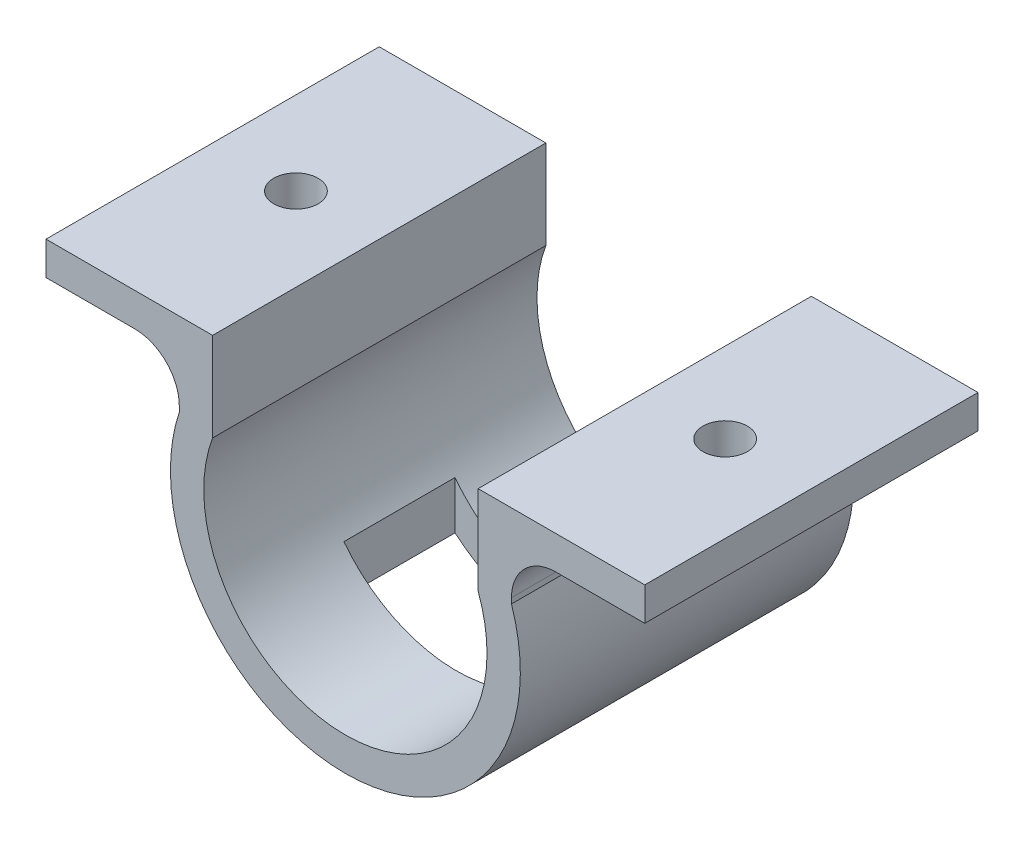
ISO-10303-21;
HEADER;
FILE_DESCRIPTION(('STEP AP214'),'2;1');
FILE_NAME('part.step','',(''),(''),'','','');
FILE_SCHEMA(('AUTOMOTIVE_DESIGN { 1 0 10303 214 1 1 1 1 }'));
ENDSEC;
DATA;
#1=APPLICATION_CONTEXT('core data for automotive mechanical design processes');
#2=APPLICATION_PROTOCOL_DEFINITION('international standard','automotive_design',2000,#1);
#3=PRODUCT_CONTEXT('',#1,'mechanical');
#4=PRODUCT('Part','Part','',(#3));
#5=PRODUCT_RELATED_PRODUCT_CATEGORY('part','',(#4));
#6=PRODUCT_DEFINITION_FORMATION('','',#4);
#7=PRODUCT_DEFINITION_CONTEXT('part definition',#1,'design');
#8=PRODUCT_DEFINITION('design','',#6,#7);
#9=PRODUCT_DEFINITION_SHAPE('','',#8);
#10=(LENGTH_UNIT() NAMED_UNIT(*) SI_UNIT(.MILLI.,.METRE.));
#11=(NAMED_UNIT(*) PLANE_ANGLE_UNIT() SI_UNIT($,.RADIAN.));
#12=(NAMED_UNIT(*) SI_UNIT($,.STERADIAN.) SOLID_ANGLE_UNIT());
#13=UNCERTAINTY_MEASURE_WITH_UNIT(LENGTH_MEASURE(1.E-05),#10,'distance_accuracy_value','');
#14=(GEOMETRIC_REPRESENTATION_CONTEXT(3) GLOBAL_UNCERTAINTY_ASSIGNED_CONTEXT((#13)) GLOBAL_UNIT_ASSIGNED_CONTEXT((#10,
#11,#12)) REPRESENTATION_CONTEXT('',''));
#15=CARTESIAN_POINT('',(0.,0.,0.));
#16=DIRECTION('',(0.,0.,1.));
#17=DIRECTION('',(1.,0.,0.));
#18=AXIS2_PLACEMENT_3D('',#15,#16,#17);
#19=CARTESIAN_POINT('',(12.0855734685662,9.43593893393396,15.));
#20=DIRECTION('',(0.,1.,0.));
#21=DIRECTION('',(-1.,0.,0.));
#22=AXIS2_PLACEMENT_3D('',#19,#20,#21);
#23=PLANE('',#22);
#24=DIRECTION('',(0.,0.,-1.));
#25=VECTOR('',#24,1.);
#26=CARTESIAN_POINT('',(19.0855734685662,9.43593893393396,-15.));
#27=LINE('',#26,#25);
#28=CARTESIAN_POINT('',(19.0855734685662,9.43593893393396,15.));
#29=VERTEX_POINT('',#28);
#30=CARTESIAN_POINT('',(19.0855734685662,9.43593893393396,1.98605672797808));
#31=VERTEX_POINT('',#30);
#32=EDGE_CURVE('E179',#29,#31,#27,.T.);
#33=ORIENTED_EDGE('',*,*,#32,.T.);
#34=CARTESIAN_POINT('',(19.321324763903,9.43593893393396,0.));
#35=DIRECTION('',(0.,1.,0.));
#36=DIRECTION('',(-1.,0.,0.));
#37=AXIS2_PLACEMENT_3D('',#34,#35,#36);
#38=CIRCLE('',#37,2.);
#39=CARTESIAN_POINT('',(19.0855734685662,9.43593893393396,-1.9860567279781));
#40=VERTEX_POINT('',#39);
#41=EDGE_CURVE('E51',#31,#40,#38,.T.);
#42=ORIENTED_EDGE('',*,*,#41,.T.);
#43=CARTESIAN_POINT('',(19.0855734685662,9.43593893393396,-15.));
#44=VERTEX_POINT('',#43);
#45=EDGE_CURVE('E176',#40,#44,#27,.T.);
#46=ORIENTED_EDGE('',*,*,#45,.T.);
#47=DIRECTION('',(1.,0.,0.));
#48=VECTOR('',#47,1.);
#49=CARTESIAN_POINT('',(12.0855734685662,9.43593893393396,-15.));
#50=LINE('',#49,#48);
#51=CARTESIAN_POINT('',(27.0855734685662,9.43593893393396,-15.));
#52=VERTEX_POINT('',#51);
#53=EDGE_CURVE('E332',#44,#52,#50,.T.);
#54=ORIENTED_EDGE('',*,*,#53,.T.);
#55=DIRECTION('',(0.,0.,-1.));
#56=VECTOR('',#55,1.);
#57=CARTESIAN_POINT('',(27.0855734685662,9.43593893393396,15.));
#58=LINE('',#57,#56);
#59=CARTESIAN_POINT('',(27.0855734685662,9.43593893393396,15.));
#60=VERTEX_POINT('',#59);
#61=EDGE_CURVE('E187',#60,#52,#58,.T.);
#62=ORIENTED_EDGE('',*,*,#61,.F.);
#63=DIRECTION('',(1.,0.,0.));
#64=VECTOR('',#63,1.);
#65=CARTESIAN_POINT('',(12.0855734685662,9.43593893393396,15.));
#66=LINE('',#65,#64);
#67=EDGE_CURVE('E366',#29,#60,#66,.T.);
#68=ORIENTED_EDGE('',*,*,#67,.F.);
#69=EDGE_LOOP('',(#33,#42,#46,#54,#62,#68));
#70=FACE_BOUND('',#69,.T.);
#71=ADVANCED_FACE('F33',(#70),#23,.F.);
#72=CARTESIAN_POINT('',(27.0855734685662,12.435938933934,15.));
#73=DIRECTION('',(1.,0.,0.));
#74=DIRECTION('',(0.,0.,-1.));
#75=AXIS2_PLACEMENT_3D('',#72,#73,#74);
#76=PLANE('',#75);
#77=DIRECTION('',(0.,-1.,0.));
#78=VECTOR('',#77,1.);
#79=CARTESIAN_POINT('',(27.0855734685662,12.435938933934,-15.));
#80=LINE('',#79,#78);
#81=CARTESIAN_POINT('',(27.0855734685662,12.435938933934,-15.));
#82=VERTEX_POINT('',#81);
#83=EDGE_CURVE('E334',#82,#52,#80,.T.);
#84=ORIENTED_EDGE('',*,*,#83,.F.);
#85=DIRECTION('',(0.,0.,-1.));
#86=VECTOR('',#85,1.);
#87=CARTESIAN_POINT('',(27.0855734685662,12.435938933934,15.));
#88=LINE('',#87,#86);
#89=CARTESIAN_POINT('',(27.0855734685662,12.435938933934,15.));
#90=VERTEX_POINT('',#89);
#91=EDGE_CURVE('E191',#90,#82,#88,.T.);
#92=ORIENTED_EDGE('',*,*,#91,.F.);
#93=DIRECTION('',(0.,-1.,0.));
#94=VECTOR('',#93,1.);
#95=CARTESIAN_POINT('',(27.0855734685662,12.435938933934,15.));
#96=LINE('',#95,#94);
#97=EDGE_CURVE('E399',#90,#60,#96,.T.);
#98=ORIENTED_EDGE('',*,*,#97,.T.);
#99=ORIENTED_EDGE('',*,*,#61,.T.);
#100=EDGE_LOOP('',(#84,#92,#98,#99));
#101=FACE_BOUND('',#100,.T.);
#102=ADVANCED_FACE('F293',(#101),#76,.T.);
#103=CARTESIAN_POINT('',(12.0855734685662,12.435938933934,15.));
#104=DIRECTION('',(0.,1.,0.));
#105=DIRECTION('',(-1.,0.,0.));
#106=AXIS2_PLACEMENT_3D('',#103,#104,#105);
#107=PLANE('',#106);
#108=CARTESIAN_POINT('',(19.321324763903,12.435938933934,0.));
#109=DIRECTION('',(0.,1.,0.));
#110=DIRECTION('',(-1.,0.,0.));
#111=AXIS2_PLACEMENT_3D('',#108,#109,#110);
#112=CIRCLE('',#111,2.);
#113=CARTESIAN_POINT('',(17.321324763903,12.435938933934,0.));
#114=VERTEX_POINT('',#113);
#115=EDGE_CURVE('E181',#114,#114,#112,.T.);
#116=ORIENTED_EDGE('',*,*,#115,.F.);
#117=EDGE_LOOP('',(#116));
#118=FACE_BOUND('',#117,.T.);
#119=DIRECTION('',(1.,0.,0.));
#120=VECTOR('',#119,1.);
#121=CARTESIAN_POINT('',(12.0855734685662,12.435938933934,-15.));
#122=LINE('',#121,#120);
#123=CARTESIAN_POINT('',(12.0855734685662,12.435938933934,-15.));
#124=VERTEX_POINT('',#123);
#125=EDGE_CURVE('E338',#124,#82,#122,.T.);
#126=ORIENTED_EDGE('',*,*,#125,.F.);
#127=DIRECTION('',(0.,0.,-1.));
#128=VECTOR('',#127,1.);
#129=CARTESIAN_POINT('',(12.0855734685662,12.435938933934,15.));
#130=LINE('',#129,#128);
#131=CARTESIAN_POINT('',(12.0855734685662,12.435938933934,15.));
#132=VERTEX_POINT('',#131);
#133=EDGE_CURVE('E382',#132,#124,#130,.T.);
#134=ORIENTED_EDGE('',*,*,#133,.F.);
#135=DIRECTION('',(1.,0.,0.));
#136=VECTOR('',#135,1.);
#137=CARTESIAN_POINT('',(12.0855734685662,12.435938933934,15.));
#138=LINE('',#137,#136);
#139=EDGE_CURVE('E388',#132,#90,#138,.T.);
#140=ORIENTED_EDGE('',*,*,#139,.T.);
#141=ORIENTED_EDGE('',*,*,#91,.T.);
#142=EDGE_LOOP('',(#126,#134,#140,#141));
#143=FACE_BOUND('',#142,.T.);
#144=ADVANCED_FACE('F289',(#118,#143),#107,.T.);
#145=CARTESIAN_POINT('',(12.0855734685662,4.43593893393397,15.));
#146=DIRECTION('',(-1.,0.,0.));
#147=DIRECTION('',(0.,-1.,0.));
#148=AXIS2_PLACEMENT_3D('',#145,#146,#147);
#149=PLANE('',#148);
#150=DIRECTION('',(0.,1.,0.));
#151=VECTOR('',#150,1.);
#152=CARTESIAN_POINT('',(12.0855734685662,4.43593893393397,-15.));
#153=LINE('',#152,#151);
#154=CARTESIAN_POINT('',(12.0855734685662,4.43593893393397,-15.));
#155=VERTEX_POINT('',#154);
#156=EDGE_CURVE('E341',#155,#124,#153,.T.);
#157=ORIENTED_EDGE('',*,*,#156,.F.);
#158=DIRECTION('',(0.,0.,-1.));
#159=VECTOR('',#158,1.);
#160=CARTESIAN_POINT('',(12.0855734685662,4.43593893393397,15.));
#161=LINE('',#160,#159);
#162=CARTESIAN_POINT('',(12.0855734685662,4.43593893393397,15.));
#163=VERTEX_POINT('',#162);
#164=EDGE_CURVE('E380',#163,#155,#161,.T.);
#165=ORIENTED_EDGE('',*,*,#164,.F.);
#166=DIRECTION('',(0.,1.,0.));
#167=VECTOR('',#166,1.);
#168=CARTESIAN_POINT('',(12.0855734685662,4.43593893393397,15.));
#169=LINE('',#168,#167);
#170=EDGE_CURVE('E396',#163,#132,#169,.T.);
#171=ORIENTED_EDGE('',*,*,#170,.T.);
#172=ORIENTED_EDGE('',*,*,#133,.T.);
#173=EDGE_LOOP('',(#157,#165,#171,#172));
#174=FACE_BOUND('',#173,.T.);
#175=ADVANCED_FACE('F285',(#174),#149,.T.);
#176=CARTESIAN_POINT('',(0.132124352331599,0.,15.));
#177=DIRECTION('',(0.,0.,-1.));
#178=DIRECTION('',(-1.,0.,0.));
#179=AXIS2_PLACEMENT_3D('',#176,#177,#178);
#180=CYLINDRICAL_SURFACE('',#179,12.75);
#181=DIRECTION('',(0.,0.,-1.));
#182=VECTOR('',#181,1.);
#183=CARTESIAN_POINT('',(10.,-8.07387950133971,15.));
#184=LINE('',#183,#182);
#185=CARTESIAN_POINT('',(10.,-8.07387950133971,5.));
#186=VERTEX_POINT('',#185);
#187=CARTESIAN_POINT('',(10.,-8.07387950133971,-5.));
#188=VERTEX_POINT('',#187);
#189=EDGE_CURVE('E335',#186,#188,#184,.T.);
#190=ORIENTED_EDGE('',*,*,#189,.F.);
#191=CARTESIAN_POINT('',(0.132124352331599,0.,5.));
#192=DIRECTION('',(0.,0.,1.));
#193=DIRECTION('',(1.,0.,0.));
#194=AXIS2_PLACEMENT_3D('',#191,#192,#193);
#195=CIRCLE('',#194,12.75);
#196=CARTESIAN_POINT('',(-9.99999999999999,-7.73967416038232,5.));
#197=VERTEX_POINT('',#196);
#198=EDGE_CURVE('E428',#197,#186,#195,.T.);
#199=ORIENTED_EDGE('',*,*,#198,.F.);
#200=DIRECTION('',(0.,0.,-1.));
#201=VECTOR('',#200,1.);
#202=CARTESIAN_POINT('',(-9.99999999999999,-7.73967416038232,15.));
#203=LINE('',#202,#201);
#204=CARTESIAN_POINT('',(-9.99999999999999,-7.73967416038232,-5.));
#205=VERTEX_POINT('',#204);
#206=EDGE_CURVE('E430',#205,#197,#203,.F.);
#207=ORIENTED_EDGE('',*,*,#206,.F.);
#208=CARTESIAN_POINT('',(0.132124352331599,0.,-5.));
#209=DIRECTION('',(0.,0.,-1.));
#210=DIRECTION('',(-1.,0.,0.));
#211=AXIS2_PLACEMENT_3D('',#208,#209,#210);
#212=CIRCLE('',#211,12.75);
#213=EDGE_CURVE('E432',#188,#205,#212,.T.);
#214=ORIENTED_EDGE('',*,*,#213,.F.);
#215=EDGE_LOOP('',(#190,#199,#207,#214));
#216=FACE_BOUND('',#215,.T.);
#217=CARTESIAN_POINT('',(0.132124352331599,0.,-15.));
#218=DIRECTION('',(0.,0.,1.));
#219=DIRECTION('',(1.,0.,0.));
#220=AXIS2_PLACEMENT_3D('',#217,#218,#219);
#221=CIRCLE('',#220,12.75);
#222=CARTESIAN_POINT('',(-11.821324763903,4.43593893393397,-15.));
#223=VERTEX_POINT('',#222);
#224=EDGE_CURVE('E344',#223,#155,#221,.T.);
#225=ORIENTED_EDGE('',*,*,#224,.F.);
#226=DIRECTION('',(0.,0.,-1.));
#227=VECTOR('',#226,1.);
#228=CARTESIAN_POINT('',(-11.821324763903,4.43593893393397,15.));
#229=LINE('',#228,#227);
#230=CARTESIAN_POINT('',(-11.821324763903,4.43593893393397,15.));
#231=VERTEX_POINT('',#230);
#232=EDGE_CURVE('E378',#231,#223,#229,.T.);
#233=ORIENTED_EDGE('',*,*,#232,.F.);
#234=CARTESIAN_POINT('',(0.132124352331599,0.,15.));
#235=DIRECTION('',(0.,0.,1.));
#236=DIRECTION('',(1.,0.,0.));
#237=AXIS2_PLACEMENT_3D('',#234,#235,#236);
#238=CIRCLE('',#237,12.75);
#239=EDGE_CURVE('E401',#231,#163,#238,.T.);
#240=ORIENTED_EDGE('',*,*,#239,.T.);
#241=ORIENTED_EDGE('',*,*,#164,.T.);
#242=EDGE_LOOP('',(#225,#233,#240,#241));
#243=FACE_BOUND('',#242,.T.);
#244=ADVANCED_FACE('F281',(#216,#243),#180,.F.);
#245=CARTESIAN_POINT('',(-11.821324763903,4.43593893393397,15.));
#246=DIRECTION('',(1.,0.,0.));
#247=DIRECTION('',(0.,1.,0.));
#248=AXIS2_PLACEMENT_3D('',#245,#246,#247);
#249=PLANE('',#248);
#250=DIRECTION('',(0.,-1.,0.));
#251=VECTOR('',#250,1.);
#252=CARTESIAN_POINT('',(-11.821324763903,4.43593893393397,-15.));
#253=LINE('',#252,#251);
#254=CARTESIAN_POINT('',(-11.821324763903,12.435938933934,-15.));
#255=VERTEX_POINT('',#254);
#256=EDGE_CURVE('E347',#255,#223,#253,.T.);
#257=ORIENTED_EDGE('',*,*,#256,.F.);
#258=DIRECTION('',(0.,0.,-1.));
#259=VECTOR('',#258,1.);
#260=CARTESIAN_POINT('',(-11.821324763903,12.435938933934,15.));
#261=LINE('',#260,#259);
#262=CARTESIAN_POINT('',(-11.821324763903,12.435938933934,15.));
#263=VERTEX_POINT('',#262);
#264=EDGE_CURVE('E376',#263,#255,#261,.T.);
#265=ORIENTED_EDGE('',*,*,#264,.F.);
#266=DIRECTION('',(0.,-1.,0.));
#267=VECTOR('',#266,1.);
#268=CARTESIAN_POINT('',(-11.821324763903,4.43593893393397,15.));
#269=LINE('',#268,#267);
#270=EDGE_CURVE('E407',#263,#231,#269,.T.);
#271=ORIENTED_EDGE('',*,*,#270,.T.);
#272=ORIENTED_EDGE('',*,*,#232,.T.);
#273=EDGE_LOOP('',(#257,#265,#271,#272));
#274=FACE_BOUND('',#273,.T.);
#275=ADVANCED_FACE('F277',(#274),#249,.T.);
#276=CARTESIAN_POINT('',(-11.821324763903,12.435938933934,15.));
#277=DIRECTION('',(0.,1.,0.));
#278=DIRECTION('',(-1.,0.,0.));
#279=AXIS2_PLACEMENT_3D('',#276,#277,#278);
#280=PLANE('',#279);
#281=CARTESIAN_POINT('',(-19.321324763903,12.435938933934,0.));
#282=DIRECTION('',(0.,1.,0.));
#283=DIRECTION('',(-1.,0.,0.));
#284=AXIS2_PLACEMENT_3D('',#281,#282,#283);
#285=CIRCLE('',#284,2.);
#286=CARTESIAN_POINT('',(-21.321324763903,12.435938933934,0.));
#287=VERTEX_POINT('',#286);
#288=EDGE_CURVE('E180',#287,#287,#285,.T.);
#289=ORIENTED_EDGE('',*,*,#288,.F.);
#290=EDGE_LOOP('',(#289));
#291=FACE_BOUND('',#290,.T.);
#292=DIRECTION('',(1.,0.,0.));
#293=VECTOR('',#292,1.);
#294=CARTESIAN_POINT('',(-11.821324763903,12.435938933934,-15.));
#295=LINE('',#294,#293);
#296=CARTESIAN_POINT('',(-26.821324763903,12.435938933934,-15.));
#297=VERTEX_POINT('',#296);
#298=EDGE_CURVE('E350',#297,#255,#295,.T.);
#299=ORIENTED_EDGE('',*,*,#298,.F.);
#300=DIRECTION('',(0.,0.,-1.));
#301=VECTOR('',#300,1.);
#302=CARTESIAN_POINT('',(-26.821324763903,12.435938933934,15.));
#303=LINE('',#302,#301);
#304=CARTESIAN_POINT('',(-26.821324763903,12.435938933934,15.));
#305=VERTEX_POINT('',#304);
#306=EDGE_CURVE('E374',#305,#297,#303,.T.);
#307=ORIENTED_EDGE('',*,*,#306,.F.);
#308=DIRECTION('',(1.,0.,0.));
#309=VECTOR('',#308,1.);
#310=CARTESIAN_POINT('',(-11.821324763903,12.435938933934,15.));
#311=LINE('',#310,#309);
#312=EDGE_CURVE('E324',#305,#263,#311,.T.);
#313=ORIENTED_EDGE('',*,*,#312,.T.);
#314=ORIENTED_EDGE('',*,*,#264,.T.);
#315=EDGE_LOOP('',(#299,#307,#313,#314));
#316=FACE_BOUND('',#315,.T.);
#317=ADVANCED_FACE('F273',(#291,#316),#280,.T.);
#318=CARTESIAN_POINT('',(-26.821324763903,9.43593893393396,15.));
#319=DIRECTION('',(-1.,0.,0.));
#320=DIRECTION('',(0.,0.,1.));
#321=AXIS2_PLACEMENT_3D('',#318,#319,#320);
#322=PLANE('',#321);
#323=DIRECTION('',(0.,1.,0.));
#324=VECTOR('',#323,1.);
#325=CARTESIAN_POINT('',(-26.821324763903,9.43593893393396,-15.));
#326=LINE('',#325,#324);
#327=CARTESIAN_POINT('',(-26.821324763903,9.43593893393396,-15.));
#328=VERTEX_POINT('',#327);
#329=EDGE_CURVE('E353',#328,#297,#326,.T.);
#330=ORIENTED_EDGE('',*,*,#329,.F.);
#331=DIRECTION('',(0.,0.,-1.));
#332=VECTOR('',#331,1.);
#333=CARTESIAN_POINT('',(-26.821324763903,9.43593893393396,15.));
#334=LINE('',#333,#332);
#335=CARTESIAN_POINT('',(-26.821324763903,9.43593893393396,15.));
#336=VERTEX_POINT('',#335);
#337=EDGE_CURVE('E372',#336,#328,#334,.T.);
#338=ORIENTED_EDGE('',*,*,#337,.F.);
#339=DIRECTION('',(0.,1.,0.));
#340=VECTOR('',#339,1.);
#341=CARTESIAN_POINT('',(-26.821324763903,9.43593893393396,15.));
#342=LINE('',#341,#340);
#343=EDGE_CURVE('E319',#336,#305,#342,.T.);
#344=ORIENTED_EDGE('',*,*,#343,.T.);
#345=ORIENTED_EDGE('',*,*,#306,.T.);
#346=EDGE_LOOP('',(#330,#338,#344,#345));
#347=FACE_BOUND('',#346,.T.);
#348=ADVANCED_FACE('F269',(#347),#322,.T.);
#349=CARTESIAN_POINT('',(-11.821324763903,9.43593893393396,15.));
#350=DIRECTION('',(0.,1.,0.));
#351=DIRECTION('',(-1.,0.,0.));
#352=AXIS2_PLACEMENT_3D('',#349,#350,#351);
#353=PLANE('',#352);
#354=DIRECTION('',(0.,0.,-1.));
#355=VECTOR('',#354,1.);
#356=CARTESIAN_POINT('',(-18.821324763903,9.43593893393396,15.));
#357=LINE('',#356,#355);
#358=CARTESIAN_POINT('',(-18.821324763903,9.43593893393396,-15.));
#359=VERTEX_POINT('',#358);
#360=CARTESIAN_POINT('',(-18.821324763903,9.43593893393396,-1.93649167310372));
#361=VERTEX_POINT('',#360);
#362=EDGE_CURVE('E200',#359,#361,#357,.F.);
#363=ORIENTED_EDGE('',*,*,#362,.T.);
#364=CARTESIAN_POINT('',(-19.321324763903,9.43593893393396,0.));
#365=DIRECTION('',(0.,1.,0.));
#366=DIRECTION('',(-1.,0.,0.));
#367=AXIS2_PLACEMENT_3D('',#364,#365,#366);
#368=CIRCLE('',#367,2.);
#369=CARTESIAN_POINT('',(-18.821324763903,9.43593893393396,1.93649167310372));
#370=VERTEX_POINT('',#369);
#371=EDGE_CURVE('E57',#361,#370,#368,.T.);
#372=ORIENTED_EDGE('',*,*,#371,.T.);
#373=CARTESIAN_POINT('',(-18.821324763903,9.43593893393396,15.));
#374=VERTEX_POINT('',#373);
#375=EDGE_CURVE('E199',#370,#374,#357,.F.);
#376=ORIENTED_EDGE('',*,*,#375,.T.);
#377=DIRECTION('',(1.,0.,0.));
#378=VECTOR('',#377,1.);
#379=CARTESIAN_POINT('',(-11.821324763903,9.43593893393396,15.));
#380=LINE('',#379,#378);
#381=EDGE_CURVE('E313',#336,#374,#380,.T.);
#382=ORIENTED_EDGE('',*,*,#381,.F.);
#383=ORIENTED_EDGE('',*,*,#337,.T.);
#384=DIRECTION('',(1.,0.,0.));
#385=VECTOR('',#384,1.);
#386=CARTESIAN_POINT('',(-11.821324763903,9.43593893393396,-15.));
#387=LINE('',#386,#385);
#388=EDGE_CURVE('E356',#328,#359,#387,.T.);
#389=ORIENTED_EDGE('',*,*,#388,.T.);
#390=EDGE_LOOP('',(#363,#372,#376,#382,#383,#389));
#391=FACE_BOUND('',#390,.T.);
#392=ADVANCED_FACE('F265',(#391),#353,.F.);
#393=CARTESIAN_POINT('',(-14.821324763903,4.43593893393398,15.));
#394=DIRECTION('',(1.,0.,0.));
#395=DIRECTION('',(0.,1.,0.));
#396=AXIS2_PLACEMENT_3D('',#393,#394,#395);
#397=PLANE('',#396);
#398=DIRECTION('',(0.,-1.,0.));
#399=VECTOR('',#398,1.);
#400=CARTESIAN_POINT('',(-14.821324763903,4.43593893393398,15.));
#401=LINE('',#400,#399);
#402=CARTESIAN_POINT('',(-14.821324763903,5.43593893393395,15.));
#403=VERTEX_POINT('',#402);
#404=CARTESIAN_POINT('',(-14.821324763903,4.94538770251473,15.));
#405=VERTEX_POINT('',#404);
#406=EDGE_CURVE('E320',#403,#405,#401,.T.);
#407=ORIENTED_EDGE('',*,*,#406,.F.);
#408=DIRECTION('',(0.,0.,-1.));
#409=VECTOR('',#408,1.);
#410=CARTESIAN_POINT('',(-14.821324763903,5.43593893393395,-15.));
#411=LINE('',#410,#409);
#412=CARTESIAN_POINT('',(-14.821324763903,5.43593893393395,-15.));
#413=VERTEX_POINT('',#412);
#414=EDGE_CURVE('E196',#403,#413,#411,.T.);
#415=ORIENTED_EDGE('',*,*,#414,.T.);
#416=DIRECTION('',(0.,-1.,0.));
#417=VECTOR('',#416,1.);
#418=CARTESIAN_POINT('',(-14.821324763903,4.43593893393398,-15.));
#419=LINE('',#418,#417);
#420=CARTESIAN_POINT('',(-14.821324763903,4.94538770251473,-15.));
#421=VERTEX_POINT('',#420);
#422=EDGE_CURVE('E359',#413,#421,#419,.T.);
#423=ORIENTED_EDGE('',*,*,#422,.T.);
#424=DIRECTION('',(0.,0.,-1.));
#425=VECTOR('',#424,1.);
#426=CARTESIAN_POINT('',(-14.821324763903,4.94538770251473,15.));
#427=LINE('',#426,#425);
#428=EDGE_CURVE('E369',#405,#421,#427,.T.);
#429=ORIENTED_EDGE('',*,*,#428,.F.);
#430=EDGE_LOOP('',(#407,#415,#423,#429));
#431=FACE_BOUND('',#430,.T.);
#432=ADVANCED_FACE('F261',(#431),#397,.F.);
#433=CARTESIAN_POINT('',(0.132124352331599,0.,15.));
#434=DIRECTION('',(0.,0.,-1.));
#435=DIRECTION('',(-1.,0.,0.));
#436=AXIS2_PLACEMENT_3D('',#433,#434,#435);
#437=CYLINDRICAL_SURFACE('',#436,15.75);
#438=DIRECTION('',(0.,0.,-1.));
#439=VECTOR('',#438,1.);
#440=CARTESIAN_POINT('',(10.,-12.2754849273727,15.));
#441=LINE('',#440,#439);
#442=CARTESIAN_POINT('',(10.,-12.2754849273727,5.));
#443=VERTEX_POINT('',#442);
#444=CARTESIAN_POINT('',(10.,-12.2754849273727,-5.));
#445=VERTEX_POINT('',#444);
#446=EDGE_CURVE('E219',#443,#445,#441,.T.);
#447=ORIENTED_EDGE('',*,*,#446,.T.);
#448=CARTESIAN_POINT('',(0.132124352331599,0.,-5.));
#449=DIRECTION('',(0.,0.,-1.));
#450=DIRECTION('',(-1.,0.,0.));
#451=AXIS2_PLACEMENT_3D('',#448,#449,#450);
#452=CIRCLE('',#451,15.75);
#453=CARTESIAN_POINT('',(-9.99999999999999,-12.058298226072,-5.));
#454=VERTEX_POINT('',#453);
#455=EDGE_CURVE('E210',#445,#454,#452,.T.);
#456=ORIENTED_EDGE('',*,*,#455,.T.);
#457=DIRECTION('',(0.,0.,-1.));
#458=VECTOR('',#457,1.);
#459=CARTESIAN_POINT('',(-9.99999999999999,-12.058298226072,15.));
#460=LINE('',#459,#458);
#461=CARTESIAN_POINT('',(-9.99999999999999,-12.058298226072,5.));
#462=VERTEX_POINT('',#461);
#463=EDGE_CURVE('E213',#454,#462,#460,.F.);
#464=ORIENTED_EDGE('',*,*,#463,.T.);
#465=CARTESIAN_POINT('',(0.132124352331599,0.,5.));
#466=DIRECTION('',(0.,0.,1.));
#467=DIRECTION('',(1.,0.,0.));
#468=AXIS2_PLACEMENT_3D('',#465,#466,#467);
#469=CIRCLE('',#468,15.75);
#470=EDGE_CURVE('E216',#462,#443,#469,.T.);
#471=ORIENTED_EDGE('',*,*,#470,.T.);
#472=EDGE_LOOP('',(#447,#456,#464,#471));
#473=FACE_BOUND('',#472,.T.);
#474=CARTESIAN_POINT('',(0.132124352331599,0.,-15.));
#475=DIRECTION('',(0.,0.,1.));
#476=DIRECTION('',(1.,0.,0.));
#477=AXIS2_PLACEMENT_3D('',#474,#475,#476);
#478=CIRCLE('',#477,15.75);
#479=CARTESIAN_POINT('',(15.0855734685662,4.94538770251473,-15.));
#480=VERTEX_POINT('',#479);
#481=EDGE_CURVE('E361',#421,#480,#478,.T.);
#482=ORIENTED_EDGE('',*,*,#481,.T.);
#483=DIRECTION('',(0.,0.,-1.));
#484=VECTOR('',#483,1.);
#485=CARTESIAN_POINT('',(15.0855734685662,4.94538770251473,15.));
#486=LINE('',#485,#484);
#487=CARTESIAN_POINT('',(15.0855734685662,4.94538770251473,15.));
#488=VERTEX_POINT('',#487);
#489=EDGE_CURVE('E331',#488,#480,#486,.T.);
#490=ORIENTED_EDGE('',*,*,#489,.F.);
#491=CARTESIAN_POINT('',(0.132124352331599,0.,15.));
#492=DIRECTION('',(0.,0.,1.));
#493=DIRECTION('',(1.,0.,0.));
#494=AXIS2_PLACEMENT_3D('',#491,#492,#493);
#495=CIRCLE('',#494,15.75);
#496=EDGE_CURVE('E322',#405,#488,#495,.T.);
#497=ORIENTED_EDGE('',*,*,#496,.F.);
#498=ORIENTED_EDGE('',*,*,#428,.T.);
#499=EDGE_LOOP('',(#482,#490,#497,#498));
#500=FACE_BOUND('',#499,.T.);
#501=ADVANCED_FACE('F257',(#473,#500),#437,.T.);
#502=CARTESIAN_POINT('',(15.0855734685662,4.43593893393398,15.));
#503=DIRECTION('',(-1.,0.,0.));
#504=DIRECTION('',(0.,-1.,0.));
#505=AXIS2_PLACEMENT_3D('',#502,#503,#504);
#506=PLANE('',#505);
#507=DIRECTION('',(0.,1.,0.));
#508=VECTOR('',#507,1.);
#509=CARTESIAN_POINT('',(15.0855734685662,4.43593893393398,-15.));
#510=LINE('',#509,#508);
#511=CARTESIAN_POINT('',(15.0855734685662,5.43593893393395,-15.));
#512=VERTEX_POINT('',#511);
#513=EDGE_CURVE('E363',#480,#512,#510,.T.);
#514=ORIENTED_EDGE('',*,*,#513,.T.);
#515=DIRECTION('',(0.,0.,-1.));
#516=VECTOR('',#515,1.);
#517=CARTESIAN_POINT('',(15.0855734685662,5.43593893393395,15.));
#518=LINE('',#517,#516);
#519=CARTESIAN_POINT('',(15.0855734685662,5.43593893393395,15.));
#520=VERTEX_POINT('',#519);
#521=EDGE_CURVE('E189',#512,#520,#518,.F.);
#522=ORIENTED_EDGE('',*,*,#521,.T.);
#523=DIRECTION('',(0.,1.,0.));
#524=VECTOR('',#523,1.);
#525=CARTESIAN_POINT('',(15.0855734685662,4.43593893393398,15.));
#526=LINE('',#525,#524);
#527=EDGE_CURVE('E329',#488,#520,#526,.T.);
#528=ORIENTED_EDGE('',*,*,#527,.F.);
#529=ORIENTED_EDGE('',*,*,#489,.T.);
#530=EDGE_LOOP('',(#514,#522,#528,#529));
#531=FACE_BOUND('',#530,.T.);
#532=ADVANCED_FACE('F250',(#531),#506,.F.);
#533=CARTESIAN_POINT('',(0.132124352331599,0.,15.));
#534=DIRECTION('',(0.,0.,1.));
#535=DIRECTION('',(1.,0.,0.));
#536=AXIS2_PLACEMENT_3D('',#533,#534,#535);
#537=PLANE('',#536);
#538=ORIENTED_EDGE('',*,*,#527,.T.);
#539=CARTESIAN_POINT('',(19.0855734685662,5.43593893393396,15.));
#540=DIRECTION('',(0.,0.,1.));
#541=DIRECTION('',(1.,0.,0.));
#542=AXIS2_PLACEMENT_3D('',#539,#540,#541);
#543=CIRCLE('',#542,4.);
#544=EDGE_CURVE('E204',#520,#29,#543,.F.);
#545=ORIENTED_EDGE('',*,*,#544,.T.);
#546=ORIENTED_EDGE('',*,*,#67,.T.);
#547=ORIENTED_EDGE('',*,*,#97,.F.);
#548=ORIENTED_EDGE('',*,*,#139,.F.);
#549=ORIENTED_EDGE('',*,*,#170,.F.);
#550=ORIENTED_EDGE('',*,*,#239,.F.);
#551=ORIENTED_EDGE('',*,*,#270,.F.);
#552=ORIENTED_EDGE('',*,*,#312,.F.);
#553=ORIENTED_EDGE('',*,*,#343,.F.);
#554=ORIENTED_EDGE('',*,*,#381,.T.);
#555=CARTESIAN_POINT('',(-18.821324763903,5.43593893393396,15.));
#556=DIRECTION('',(0.,0.,1.));
#557=DIRECTION('',(1.,0.,0.));
#558=AXIS2_PLACEMENT_3D('',#555,#556,#557);
#559=CIRCLE('',#558,4.);
#560=EDGE_CURVE('E208',#374,#403,#559,.F.);
#561=ORIENTED_EDGE('',*,*,#560,.T.);
#562=ORIENTED_EDGE('',*,*,#406,.T.);
#563=ORIENTED_EDGE('',*,*,#496,.T.);
#564=EDGE_LOOP('',(#538,#545,#546,#547,#548,#549,#550,#551,#552,#553,#554,#561,#562,#563));
#565=FACE_BOUND('',#564,.T.);
#566=ADVANCED_FACE('F246',(#565),#537,.T.);
#567=CARTESIAN_POINT('',(0.132124352331599,0.,-15.));
#568=DIRECTION('',(0.,0.,1.));
#569=DIRECTION('',(1.,0.,0.));
#570=AXIS2_PLACEMENT_3D('',#567,#568,#569);
#571=PLANE('',#570);
#572=ORIENTED_EDGE('',*,*,#53,.F.);
#573=CARTESIAN_POINT('',(19.0855734685662,5.43593893393396,-15.));
#574=DIRECTION('',(0.,0.,1.));
#575=DIRECTION('',(1.,0.,0.));
#576=AXIS2_PLACEMENT_3D('',#573,#574,#575);
#577=CIRCLE('',#576,4.);
#578=EDGE_CURVE('E185',#44,#512,#577,.T.);
#579=ORIENTED_EDGE('',*,*,#578,.T.);
#580=ORIENTED_EDGE('',*,*,#513,.F.);
#581=ORIENTED_EDGE('',*,*,#481,.F.);
#582=ORIENTED_EDGE('',*,*,#422,.F.);
#583=CARTESIAN_POINT('',(-18.821324763903,5.43593893393396,-15.));
#584=DIRECTION('',(0.,0.,1.));
#585=DIRECTION('',(1.,0.,0.));
#586=AXIS2_PLACEMENT_3D('',#583,#584,#585);
#587=CIRCLE('',#586,4.);
#588=EDGE_CURVE('E206',#413,#359,#587,.T.);
#589=ORIENTED_EDGE('',*,*,#588,.T.);
#590=ORIENTED_EDGE('',*,*,#388,.F.);
#591=ORIENTED_EDGE('',*,*,#329,.T.);
#592=ORIENTED_EDGE('',*,*,#298,.T.);
#593=ORIENTED_EDGE('',*,*,#256,.T.);
#594=ORIENTED_EDGE('',*,*,#224,.T.);
#595=ORIENTED_EDGE('',*,*,#156,.T.);
#596=ORIENTED_EDGE('',*,*,#125,.T.);
#597=ORIENTED_EDGE('',*,*,#83,.T.);
#598=EDGE_LOOP('',(#572,#579,#580,#581,#582,#589,#590,#591,#592,#593,#594,#595,#596,#597));
#599=FACE_BOUND('',#598,.T.);
#600=ADVANCED_FACE('F249',(#599),#571,.F.);
#601=CARTESIAN_POINT('',(19.0855734685662,5.43593893393396,15.));
#602=DIRECTION('',(0.,0.,1.));
#603=DIRECTION('',(1.,0.,0.));
#604=AXIS2_PLACEMENT_3D('',#601,#602,#603);
#605=CYLINDRICAL_SURFACE('',#604,4.);
#606=ORIENTED_EDGE('',*,*,#45,.F.);
#607=CARTESIAN_POINT('',(17.321324763903,9.0258451316074,0.));
#608=CARTESIAN_POINT('',(17.3213317186925,9.02585335886435,0.106314457676243));
#609=CARTESIAN_POINT('',(17.3298524206275,9.03007501996434,0.212757782375945));
#610=CARTESIAN_POINT('',(17.3635579652187,9.04633950173604,0.422466868378081));
#611=CARTESIAN_POINT('',(17.3887761878933,9.05839798811432,0.525725830182462));
#612=CARTESIAN_POINT('',(17.4546753877422,9.08853614829856,0.725711392612194));
#613=CARTESIAN_POINT('',(17.4952892980225,9.10658966476933,0.822464212999765));
#614=CARTESIAN_POINT('',(17.5906699929465,9.14645458851813,1.00782389552252));
#615=CARTESIAN_POINT('',(17.6454372128798,9.16826611136796,1.09643050700478));
#616=CARTESIAN_POINT('',(17.7718163627237,9.21467614676972,1.26933915855915));
#617=CARTESIAN_POINT('',(17.8442918978642,9.23936365951449,1.35298689114948));
#618=CARTESIAN_POINT('',(18.0022891890112,9.28734233221327,1.50743288142119));
#619=CARTESIAN_POINT('',(18.087815164785,9.31063303711393,1.57822696669468));
#620=CARTESIAN_POINT('',(18.273563522551,9.35385351325454,1.70747232569658));
#621=CARTESIAN_POINT('',(18.374215749666,9.37362511206582,1.76536331586888));
#622=CARTESIAN_POINT('',(18.5849852381373,9.40591910350905,1.86313514016607));
#623=CARTESIAN_POINT('',(18.6950958801239,9.41844651919009,1.90302844948566));
#624=CARTESIAN_POINT('',(18.9127039008271,9.43357621212015,1.96079905993294));
#625=CARTESIAN_POINT('',(19.019773770535,9.43685479222377,1.98010791107754));
#626=CARTESIAN_POINT('',(19.2355169650528,9.43458055318421,2.00109205570251));
#627=CARTESIAN_POINT('',(19.3441896235708,9.4290313067228,2.00277448062794));
#628=CARTESIAN_POINT('',(19.552380859103,9.40989176755314,1.98916409834091));
#629=CARTESIAN_POINT('',(19.6520279885131,9.39686010811018,1.97499148945252));
#630=CARTESIAN_POINT('',(19.8470104478028,9.36404204471291,1.93225793171226));
#631=CARTESIAN_POINT('',(19.9423451116271,9.34425460134238,1.90369476846897));
#632=CARTESIAN_POINT('',(20.1301094340116,9.29840461550138,1.83203434380262));
#633=CARTESIAN_POINT('',(20.2222917742882,9.27213253824261,1.78842692805914));
#634=CARTESIAN_POINT('',(20.3980911444772,9.21560004975302,1.68843525556301));
#635=CARTESIAN_POINT('',(20.4817046160287,9.18533799345092,1.63204572179886));
#636=CARTESIAN_POINT('',(20.6477324666424,9.11948034103153,1.50100517059112));
#637=CARTESIAN_POINT('',(20.7290172677418,9.08366329000246,1.42503194285892));
#638=CARTESIAN_POINT('',(20.8781329535295,9.01274788152049,1.26043555113181));
#639=CARTESIAN_POINT('',(20.9459504543688,8.97765026979728,1.17179995211205));
#640=CARTESIAN_POINT('',(21.0700929112081,8.90969538180193,0.977678499578119));
#641=CARTESIAN_POINT('',(21.1254939048983,8.87709568112525,0.87150382716589));
#642=CARTESIAN_POINT('',(21.2169401495574,8.82122808892954,0.64888909480292));
#643=CARTESIAN_POINT('',(21.2530183230151,8.79794434199644,0.532466891459127));
#644=CARTESIAN_POINT('',(21.3006073626486,8.76675721700252,0.306856071423419));
#645=CARTESIAN_POINT('',(21.3144619630934,8.75739571830103,0.19837003529823));
#646=CARTESIAN_POINT('',(21.3241970376518,8.75084681233539,-0.019741001353785));
#647=CARTESIAN_POINT('',(21.3200917015954,8.75364979411506,-0.129365034471651));
#648=CARTESIAN_POINT('',(21.2960249765642,8.76971348956773,-0.330815895429599));
#649=CARTESIAN_POINT('',(21.2782854098019,8.78150707095168,-0.423042955913128));
#650=CARTESIAN_POINT('',(21.2305327340907,8.81232055117007,-0.602988346930411));
#651=CARTESIAN_POINT('',(21.2005150198789,8.83134316126412,-0.690704971787036));
#652=CARTESIAN_POINT('',(21.1269777230482,8.87608849443625,-0.865562130639484));
#653=CARTESIAN_POINT('',(21.0827050635446,8.90216735812548,-0.952291763364204));
#654=CARTESIAN_POINT('',(20.9827251754457,8.95788320121761,-1.11762905990355));
#655=CARTESIAN_POINT('',(20.9270117063947,8.98752211879464,-1.19623225577753));
#656=CARTESIAN_POINT('',(20.7952996571099,9.05299227316861,-1.35639846324208));
#657=CARTESIAN_POINT('',(20.7174768971511,9.08904861386883,-1.43637673014104));
#658=CARTESIAN_POINT('',(20.5492061579006,9.15966164748132,-1.5826376873888));
#659=CARTESIAN_POINT('',(20.4587510247511,9.19421747599746,-1.64891256422495));
#660=CARTESIAN_POINT('',(20.2617717093932,9.26058261135379,-1.76905119005813));
#661=CARTESIAN_POINT('',(20.1546542913299,9.29215351827813,-1.82208383657239));
#662=CARTESIAN_POINT('',(19.9308918436491,9.34728997801847,-1.90860637348146));
#663=CARTESIAN_POINT('',(19.8142557334059,9.37086292076993,-1.94211432490099));
#664=CARTESIAN_POINT('',(19.5865642796886,9.40595215464515,-1.98539234768388));
#665=CARTESIAN_POINT('',(19.4760224334556,9.41839695915234,-1.99710566351994));
#666=CARTESIAN_POINT('',(19.2538958458194,9.43394296379188,-2.00194224632215));
#667=CARTESIAN_POINT('',(19.1423116957481,9.43704917319531,-1.99507548349667));
#668=CARTESIAN_POINT('',(18.9316884878469,9.43424432409326,-1.96430957571124));
#669=CARTESIAN_POINT('',(18.8324073808254,9.42910010401514,-1.94195680151471));
#670=CARTESIAN_POINT('',(18.638910141998,9.41210890217969,-1.8826976056761));
#671=CARTESIAN_POINT('',(18.5446944263549,9.40026137061001,-1.84578999030659));
#672=CARTESIAN_POINT('',(18.3615527766193,9.37098566292643,-1.75766837602128));
#673=CARTESIAN_POINT('',(18.2727904517354,9.35343957273263,-1.70615530902011));
#674=CARTESIAN_POINT('',(18.1046710295451,9.31476387172766,-1.59064967776522));
#675=CARTESIAN_POINT('',(18.0253174699638,9.29363292021106,-1.52665244319986));
#676=CARTESIAN_POINT('',(17.8708663612909,9.24796395958033,-1.38144092066168));
#677=CARTESIAN_POINT('',(17.7967692431228,9.22328997014569,-1.29920344082405));
#678=CARTESIAN_POINT('',(17.6629317207595,9.17507849792931,-1.12336512283937));
#679=CARTESIAN_POINT('',(17.6032029087443,9.15154194496918,-1.02975520056008));
#680=CARTESIAN_POINT('',(17.4977189526871,9.10773895149907,-0.829326273047571));
#681=CARTESIAN_POINT('',(17.4525997516278,9.08763587801627,-0.722134455465661));
#682=CARTESIAN_POINT('',(17.3815333866413,9.05502865266784,-0.500650597086852));
#683=CARTESIAN_POINT('',(17.3555319771,9.04250301832557,-0.386379651090798));
#684=CARTESIAN_POINT('',(17.3335944171614,9.03185337241852,-0.225793407379881));
#685=CARTESIAN_POINT('',(17.3289996609616,9.02960837154062,-0.180795367836707));
#686=CARTESIAN_POINT('',(17.3228632939798,9.02660247025449,-0.0905393513431189));
#687=CARTESIAN_POINT('',(17.3213218017249,9.02584162746104,-0.0452813643699841));
#688=CARTESIAN_POINT('',(17.321324763903,9.0258451316074,0.));
#689=B_SPLINE_CURVE_WITH_KNOTS('',3,(#607,#608,#609,#610,#611,#612,#613,#614,#615,#616,#617,
#618,#619,#620,#621,#622,#623,#624,#625,#626,#627,#628,#629,#630,#631,#632,#633,#634,#635,#636,
#637,#638,#639,#640,#641,#642,#643,#644,#645,#646,#647,#648,#649,#650,#651,#652,#653,#654,#655,
#656,#657,#658,#659,#660,#661,#662,#663,#664,#665,#666,#667,#668,#669,#670,#671,#672,#673,#674,
#675,#676,#677,#678,#679,#680,#681,#682,#683,#684,#685,#686,#687,#688),.UNSPECIFIED.,.T.,.F.,(4,
2,2,2,2,2,2,2,2,2,2,2,2,2,2,2,2,2,2,2,2,2,2,2,2,2,2,2,2,2,2,2,2,2,2,2,2,2,2,2,4),(0.,
0.318758246434048,0.638155654322305,0.956177397080625,1.27420892186377,1.61291545829492,
1.95173174606523,2.30321281770873,2.6544498825116,2.97924004139516,3.30389878891734,
3.60699126785829,3.91013040035056,4.22476684931328,4.53953343116443,4.88869801475344,
5.23820788158076,5.60851474648679,5.978188653924,6.30544934915751,6.63245152818512,
6.91518437927004,7.19802337461564,7.49931414021264,7.80076968521474,8.15107940802982,
8.50158832585645,8.87044189575177,9.23895371931427,9.57265707104741,9.90618139059779,
10.2104589817075,10.5147615335894,10.8258113372988,11.1369777282844,11.4757206995556,
11.8147360549141,12.1669752362886,12.5182110613524,12.6539710354229,12.7897362795693),.UNSPECIFIED.);
#690=EDGE_CURVE('E11',#40,#31,#689,.T.);
#691=ORIENTED_EDGE('',*,*,#690,.T.);
#692=ORIENTED_EDGE('',*,*,#32,.F.);
#693=ORIENTED_EDGE('',*,*,#544,.F.);
#694=ORIENTED_EDGE('',*,*,#521,.F.);
#695=ORIENTED_EDGE('',*,*,#578,.F.);
#696=EDGE_LOOP('',(#606,#691,#692,#693,#694,#695));
#697=FACE_BOUND('',#696,.T.);
#698=ADVANCED_FACE('F183',(#697),#605,.F.);
#699=CARTESIAN_POINT('',(-18.821324763903,5.43593893393396,15.));
#700=DIRECTION('',(0.,0.,1.));
#701=DIRECTION('',(1.,0.,0.));
#702=AXIS2_PLACEMENT_3D('',#699,#700,#701);
#703=CYLINDRICAL_SURFACE('',#702,4.);
#704=ORIENTED_EDGE('',*,*,#375,.F.);
#705=CARTESIAN_POINT('',(-21.321324763903,8.55843793313318,0.));
#706=CARTESIAN_POINT('',(-21.3213161620489,8.55845030973678,0.0986192451236804));
#707=CARTESIAN_POINT('',(-21.3139710688821,8.56436962031891,0.197320222559402));
#708=CARTESIAN_POINT('',(-21.2851199083688,8.5871330823903,0.391382754686682));
#709=CARTESIAN_POINT('',(-21.2635895993299,8.60399593500295,0.486738297891911));
#710=CARTESIAN_POINT('',(-21.2079135027116,8.64613980240615,0.6707938719814));
#711=CARTESIAN_POINT('',(-21.1738657985144,8.67135522029744,0.759539363467065));
#712=CARTESIAN_POINT('',(-21.0945382715059,8.7275736595619,0.929810808867028));
#713=CARTESIAN_POINT('',(-21.0492560449164,8.75857791918444,1.01133521265946));
#714=CARTESIAN_POINT('',(-20.942285391586,8.82799978197967,1.17614220591145));
#715=CARTESIAN_POINT('',(-20.8792517488256,8.86685947516423,1.25836347710665));
#716=CARTESIAN_POINT('',(-20.7416146122175,8.94575256502435,1.41188454664234));
#717=CARTESIAN_POINT('',(-20.6670023638288,8.98578683106154,1.48317599923035));
#718=CARTESIAN_POINT('',(-20.4947094728595,9.07054571602738,1.62400637949067));
#719=CARTESIAN_POINT('',(-20.3952459520887,9.11502677592022,1.69153395004034));
#720=CARTESIAN_POINT('',(-20.18398332267,9.19838987122188,1.80841732013907));
#721=CARTESIAN_POINT('',(-20.072186974126,9.23727315494872,1.85777717496772));
#722=CARTESIAN_POINT('',(-19.8442610041882,9.30466808397456,1.93398623530074));
#723=CARTESIAN_POINT('',(-19.7285593909355,9.33357085690252,1.96175673983406));
#724=CARTESIAN_POINT('',(-19.4920546593714,9.38113992329124,1.99626765527072));
#725=CARTESIAN_POINT('',(-19.3712576660422,9.39981814977449,2.003032624929));
#726=CARTESIAN_POINT('',(-19.1448585885017,9.4242474705551,1.99499516607266));
#727=CARTESIAN_POINT('',(-19.0393005656554,9.43135229423802,1.98285491423914));
#728=CARTESIAN_POINT('',(-18.8312366645388,9.43727911493558,1.94191802220405));
#729=CARTESIAN_POINT('',(-18.7287303164655,9.4361023935789,1.91312395993246));
#730=CARTESIAN_POINT('',(-18.5342405667407,9.42676170013642,1.84140755158224));
#731=CARTESIAN_POINT('',(-18.4419934926586,9.41890342461135,1.79915315594058));
#732=CARTESIAN_POINT('',(-18.2653727002725,9.39811415807601,1.70151512540232));
#733=CARTESIAN_POINT('',(-18.1810005826568,9.38518213852836,1.6461288293393));
#734=CARTESIAN_POINT('',(-18.0170475061074,9.35518677872822,1.51993513838421));
#735=CARTESIAN_POINT('',(-17.9380674885667,9.33792044308103,1.44839618727959));
#736=CARTESIAN_POINT('',(-17.7925403162597,9.30210369406705,1.29386802557051));
#737=CARTESIAN_POINT('',(-17.7259995546923,9.28355262708359,1.21087296494173));
#738=CARTESIAN_POINT('',(-17.6027045495566,9.24637171449956,1.02917561367944));
#739=CARTESIAN_POINT('',(-17.5469317537361,9.22782336841501,0.929787076640942));
#740=CARTESIAN_POINT('',(-17.4528802965036,9.19490942191676,0.72240392854816));
#741=CARTESIAN_POINT('',(-17.4145964702337,9.18054258707091,0.614411869372183));
#742=CARTESIAN_POINT('',(-17.3575870400467,9.15862560230801,0.39529090173133));
#743=CARTESIAN_POINT('',(-17.3384427142155,9.1509300271943,0.284286367487958));
#744=CARTESIAN_POINT('',(-17.3190853139317,9.14314762390792,0.0603970290214812));
#745=CARTESIAN_POINT('',(-17.3188634899938,9.14305727918931,-0.0524868820548027));
#746=CARTESIAN_POINT('',(-17.3367347484619,9.1502441198428,-0.269184831715787));
#747=CARTESIAN_POINT('',(-17.3536499325864,9.1570474771471,-0.373114997643865));
#748=CARTESIAN_POINT('',(-17.4033686181441,9.17627354138379,-0.576554372323349));
#749=CARTESIAN_POINT('',(-17.4361755449147,9.18869745974475,-0.676062622915971));
#750=CARTESIAN_POINT('',(-17.5174466431319,9.21770974218485,-0.870249802316611));
#751=CARTESIAN_POINT('',(-17.5662200174728,9.23437877114379,-0.96478665406137));
#752=CARTESIAN_POINT('',(-17.6779212855679,9.26948168912398,-1.14474927888608));
#753=CARTESIAN_POINT('',(-17.7408548395778,9.28791628219792,-1.23017138833997));
#754=CARTESIAN_POINT('',(-17.8841871393792,9.32536208872994,-1.39548943612747));
#755=CARTESIAN_POINT('',(-17.9654761229206,9.34432863965817,-1.474626798836));
#756=CARTESIAN_POINT('',(-18.1407379478488,9.37862342784759,-1.61834833412953));
#757=CARTESIAN_POINT('',(-18.2347099161064,9.39395191536214,-1.68293350770808));
#758=CARTESIAN_POINT('',(-18.4316899854629,9.4181361858913,-1.79477258131392));
#759=CARTESIAN_POINT('',(-18.5345702635979,9.42707058326779,-1.84223329054554));
#760=CARTESIAN_POINT('',(-18.7471985793202,9.43666346373642,-1.91914993769786));
#761=CARTESIAN_POINT('',(-18.8569417212573,9.43732778014295,-1.94861855241657));
#762=CARTESIAN_POINT('',(-19.0705935181924,9.42948077013164,-1.98694886836003));
#763=CARTESIAN_POINT('',(-19.1742703746489,9.42169629608547,-1.99726535585495));
#764=CARTESIAN_POINT('',(-19.3810209584593,9.39795389714697,-2.00178059872905));
#765=CARTESIAN_POINT('',(-19.4840947235981,9.38199648997384,-1.99598037492772));
#766=CARTESIAN_POINT('',(-19.6844228657214,9.34301650372962,-1.96930240210979));
#767=CARTESIAN_POINT('',(-19.7817557155579,9.32015914732249,-1.94876324145597));
#768=CARTESIAN_POINT('',(-19.9708428829785,9.2684612278409,-1.89415401820752));
#769=CARTESIAN_POINT('',(-20.0625960422425,9.23961942786702,-1.86008115705621));
#770=CARTESIAN_POINT('',(-20.2463208301055,9.17487600253102,-1.77634835697746));
#771=CARTESIAN_POINT('',(-20.3376671721305,9.13858541189284,-1.72562197577787));
#772=CARTESIAN_POINT('',(-20.5105983331856,9.06295999521482,-1.61133145291777));
#773=CARTESIAN_POINT('',(-20.5921740822994,9.02362239559671,-1.54775552805148));
#774=CARTESIAN_POINT('',(-20.7540868206855,8.93933281024906,-1.40023641354472));
#775=CARTESIAN_POINT('',(-20.8329668225637,8.89429908254646,-1.31473512764364));
#776=CARTESIAN_POINT('',(-20.9753991498723,8.80742552610556,-1.13030871632664));
#777=CARTESIAN_POINT('',(-21.0389553093847,8.76558490023583,-1.0313869584621));
#778=CARTESIAN_POINT('',(-21.1382075682468,8.69707018058934,-0.841504308271226));
#779=CARTESIAN_POINT('',(-21.1769035593854,8.66902506474106,-0.752608812059094));
#780=CARTESIAN_POINT('',(-21.2413616805633,8.6210686359957,-0.568272042295627));
#781=CARTESIAN_POINT('',(-21.2671562691981,8.60113693437042,-0.472847889574521));
#782=CARTESIAN_POINT('',(-21.2975256131479,8.57737885977101,-0.313920848036226));
#783=CARTESIAN_POINT('',(-21.3064219104846,8.57032122375938,-0.251697849517092));
#784=CARTESIAN_POINT('',(-21.3183246260503,8.56084649271973,-0.126327829055656));
#785=CARTESIAN_POINT('',(-21.3213302747041,8.55843000402844,-0.0631806874655774));
#786=CARTESIAN_POINT('',(-21.321324763903,8.55843793313318,0.));
#787=B_SPLINE_CURVE_WITH_KNOTS('',3,(#705,#706,#707,#708,#709,#710,#711,#712,#713,#714,#715,
#716,#717,#718,#719,#720,#721,#722,#723,#724,#725,#726,#727,#728,#729,#730,#731,#732,#733,#734,
#735,#736,#737,#738,#739,#740,#741,#742,#743,#744,#745,#746,#747,#748,#749,#750,#751,#752,#753,
#754,#755,#756,#757,#758,#759,#760,#761,#762,#763,#764,#765,#766,#767,#768,#769,#770,#771,#772,
#773,#774,#775,#776,#777,#778,#779,#780,#781,#782,#783,#784,#785,#786),.UNSPECIFIED.,.T.,.F.,(4,
2,2,2,2,2,2,2,2,2,2,2,2,2,2,2,2,2,2,2,2,2,2,2,2,2,2,2,2,2,2,2,2,2,2,2,2,2,2,2,4),(0.,
0.295579308081101,0.591665058456272,0.885478549031199,1.17935495927947,1.51008049056597,
1.8410573116433,2.22370808048744,2.60627338463743,2.9714478525347,3.33619521330651,
3.6540270847643,3.97180977053532,4.27579022320885,4.57983232994595,4.90231461722451,
5.22496219244878,5.56969141412528,5.91431876414736,6.25122980233396,6.58798505698772,
6.9030654589518,7.21821380420189,7.53986710720954,7.86164921399428,8.20508277281951,
8.54849270084952,8.88760432952779,9.22647675173195,9.53834950695878,9.85020250886752,
10.1551118613451,10.4600842971393,10.7905985968955,11.1214173692186,11.4940073590838,
11.8665040285936,12.1681398393445,12.46901289946,12.6583518523952,12.8477155395918),.UNSPECIFIED.);
#788=EDGE_CURVE('E45',#370,#361,#787,.T.);
#789=ORIENTED_EDGE('',*,*,#788,.T.);
#790=ORIENTED_EDGE('',*,*,#362,.F.);
#791=ORIENTED_EDGE('',*,*,#588,.F.);
#792=ORIENTED_EDGE('',*,*,#414,.F.);
#793=ORIENTED_EDGE('',*,*,#560,.F.);
#794=EDGE_LOOP('',(#704,#789,#790,#791,#792,#793));
#795=FACE_BOUND('',#794,.T.);
#796=ADVANCED_FACE('F35',(#795),#703,.F.);
#797=CARTESIAN_POINT('',(10.,-15.75,5.));
#798=DIRECTION('',(1.,0.,0.));
#799=DIRECTION('',(0.,1.,0.));
#800=AXIS2_PLACEMENT_3D('',#797,#798,#799);
#801=PLANE('',#800);
#802=ORIENTED_EDGE('',*,*,#189,.T.);
#803=DIRECTION('',(0.,1.,0.));
#804=VECTOR('',#803,1.);
#805=CARTESIAN_POINT('',(10.,-15.75,-5.));
#806=LINE('',#805,#804);
#807=EDGE_CURVE('E435',#445,#188,#806,.T.);
#808=ORIENTED_EDGE('',*,*,#807,.F.);
#809=ORIENTED_EDGE('',*,*,#446,.F.);
#810=DIRECTION('',(0.,1.,0.));
#811=VECTOR('',#810,1.);
#812=CARTESIAN_POINT('',(10.,-15.75,5.));
#813=LINE('',#812,#811);
#814=EDGE_CURVE('E434',#443,#186,#813,.T.);
#815=ORIENTED_EDGE('',*,*,#814,.T.);
#816=EDGE_LOOP('',(#802,#808,#809,#815));
#817=FACE_BOUND('',#816,.T.);
#818=ADVANCED_FACE('F235',(#817),#801,.F.);
#819=CARTESIAN_POINT('',(-9.99999999999999,-15.75,5.));
#820=DIRECTION('',(0.,0.,1.));
#821=DIRECTION('',(1.,0.,0.));
#822=AXIS2_PLACEMENT_3D('',#819,#820,#821);
#823=PLANE('',#822);
#824=ORIENTED_EDGE('',*,*,#198,.T.);
#825=ORIENTED_EDGE('',*,*,#814,.F.);
#826=ORIENTED_EDGE('',*,*,#470,.F.);
#827=DIRECTION('',(0.,1.,0.));
#828=VECTOR('',#827,1.);
#829=CARTESIAN_POINT('',(-9.99999999999999,-15.75,5.));
#830=LINE('',#829,#828);
#831=EDGE_CURVE('E440',#462,#197,#830,.T.);
#832=ORIENTED_EDGE('',*,*,#831,.T.);
#833=EDGE_LOOP('',(#824,#825,#826,#832));
#834=FACE_BOUND('',#833,.T.);
#835=ADVANCED_FACE('F231',(#834),#823,.F.);
#836=CARTESIAN_POINT('',(-9.99999999999999,-15.75,5.));
#837=DIRECTION('',(-1.,0.,0.));
#838=DIRECTION('',(0.,-1.,0.));
#839=AXIS2_PLACEMENT_3D('',#836,#837,#838);
#840=PLANE('',#839);
#841=ORIENTED_EDGE('',*,*,#206,.T.);
#842=ORIENTED_EDGE('',*,*,#831,.F.);
#843=ORIENTED_EDGE('',*,*,#463,.F.);
#844=DIRECTION('',(0.,1.,0.));
#845=VECTOR('',#844,1.);
#846=CARTESIAN_POINT('',(-9.99999999999999,-15.75,-5.));
#847=LINE('',#846,#845);
#848=EDGE_CURVE('E437',#454,#205,#847,.T.);
#849=ORIENTED_EDGE('',*,*,#848,.T.);
#850=EDGE_LOOP('',(#841,#842,#843,#849));
#851=FACE_BOUND('',#850,.T.);
#852=ADVANCED_FACE('F234',(#851),#840,.F.);
#853=CARTESIAN_POINT('',(-9.99999999999999,-15.75,-5.));
#854=DIRECTION('',(0.,0.,-1.));
#855=DIRECTION('',(-1.,0.,0.));
#856=AXIS2_PLACEMENT_3D('',#853,#854,#855);
#857=PLANE('',#856);
#858=ORIENTED_EDGE('',*,*,#213,.T.);
#859=ORIENTED_EDGE('',*,*,#848,.F.);
#860=ORIENTED_EDGE('',*,*,#455,.F.);
#861=ORIENTED_EDGE('',*,*,#807,.T.);
#862=EDGE_LOOP('',(#858,#859,#860,#861));
#863=FACE_BOUND('',#862,.T.);
#864=ADVANCED_FACE('F228',(#863),#857,.F.);
#865=CARTESIAN_POINT('',(-19.321324763903,-15.75,0.));
#866=DIRECTION('',(0.,1.,0.));
#867=DIRECTION('',(-1.,0.,0.));
#868=AXIS2_PLACEMENT_3D('',#865,#866,#867);
#869=CYLINDRICAL_SURFACE('',#868,2.);
#870=ORIENTED_EDGE('',*,*,#288,.T.);
#871=EDGE_LOOP('',(#870));
#872=FACE_BOUND('',#871,.T.);
#873=ORIENTED_EDGE('',*,*,#788,.F.);
#874=ORIENTED_EDGE('',*,*,#371,.F.);
#875=EDGE_LOOP('',(#873,#874));
#876=FACE_BOUND('',#875,.T.);
#877=ADVANCED_FACE('F224',(#872,#876),#869,.F.);
#878=CARTESIAN_POINT('',(19.321324763903,-15.75,0.));
#879=DIRECTION('',(0.,1.,0.));
#880=DIRECTION('',(-1.,0.,0.));
#881=AXIS2_PLACEMENT_3D('',#878,#879,#880);
#882=CYLINDRICAL_SURFACE('',#881,2.);
#883=ORIENTED_EDGE('',*,*,#115,.T.);
#884=EDGE_LOOP('',(#883));
#885=FACE_BOUND('',#884,.T.);
#886=ORIENTED_EDGE('',*,*,#690,.F.);
#887=ORIENTED_EDGE('',*,*,#41,.F.);
#888=EDGE_LOOP('',(#886,#887));
#889=FACE_BOUND('',#888,.T.);
#890=ADVANCED_FACE('F170',(#885,#889),#882,.F.);
#891=CLOSED_SHELL('',(#71,#102,#144,#175,#244,#275,#317,#348,#392,#432,#501,#532,#566,#600,#698,
#796,#818,#835,#852,#864,#877,#890));
#892=MANIFOLD_SOLID_BREP('B2',#891);
#893=ADVANCED_BREP_SHAPE_REPRESENTATION('',(#18,#892),#14);
#894=SHAPE_DEFINITION_REPRESENTATION(#9,#893);
ENDSEC;
END-ISO-10303-21;
